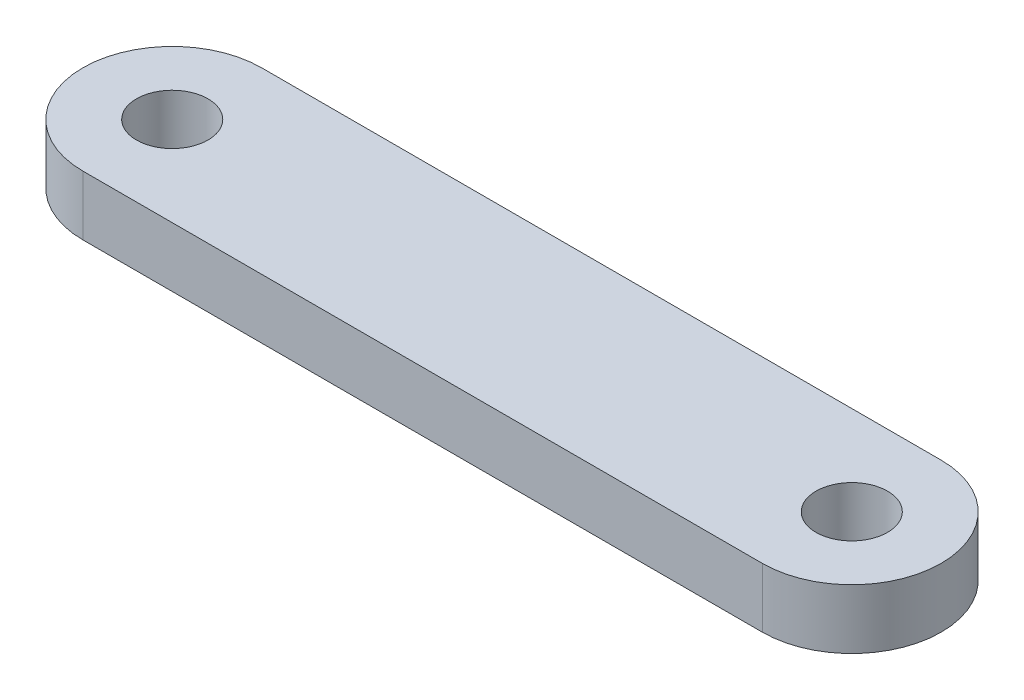
ISO-10303-21;
HEADER;
FILE_DESCRIPTION(('STEP AP214'),'2;1');
FILE_NAME('part.step','',(''),(''),'','','');
FILE_SCHEMA(('AUTOMOTIVE_DESIGN { 1 0 10303 214 1 1 1 1 }'));
ENDSEC;
DATA;
#1=APPLICATION_CONTEXT('core data for automotive mechanical design processes');
#2=APPLICATION_PROTOCOL_DEFINITION('international standard','automotive_design',2000,#1);
#3=PRODUCT_CONTEXT('',#1,'mechanical');
#4=PRODUCT('Part','Part','',(#3));
#5=PRODUCT_RELATED_PRODUCT_CATEGORY('part','',(#4));
#6=PRODUCT_DEFINITION_FORMATION('','',#4);
#7=PRODUCT_DEFINITION_CONTEXT('part definition',#1,'design');
#8=PRODUCT_DEFINITION('design','',#6,#7);
#9=PRODUCT_DEFINITION_SHAPE('','',#8);
#10=(LENGTH_UNIT() NAMED_UNIT(*) SI_UNIT(.MILLI.,.METRE.));
#11=(NAMED_UNIT(*) PLANE_ANGLE_UNIT() SI_UNIT($,.RADIAN.));
#12=(NAMED_UNIT(*) SI_UNIT($,.STERADIAN.) SOLID_ANGLE_UNIT());
#13=UNCERTAINTY_MEASURE_WITH_UNIT(LENGTH_MEASURE(1.E-05),#10,'distance_accuracy_value','');
#14=(GEOMETRIC_REPRESENTATION_CONTEXT(3) GLOBAL_UNCERTAINTY_ASSIGNED_CONTEXT((#13)) GLOBAL_UNIT_ASSIGNED_CONTEXT((#10,
#11,#12)) REPRESENTATION_CONTEXT('',''));
#15=CARTESIAN_POINT('',(0.,0.,0.));
#16=DIRECTION('',(0.,0.,1.));
#17=DIRECTION('',(1.,0.,0.));
#18=AXIS2_PLACEMENT_3D('',#15,#16,#17);
#19=CARTESIAN_POINT('',(0.,5.,0.));
#20=DIRECTION('',(0.,1.,0.));
#21=DIRECTION('',(0.,0.,1.));
#22=AXIS2_PLACEMENT_3D('',#19,#20,#21);
#23=PLANE('',#22);
#24=CARTESIAN_POINT('',(57.,5.,0.));
#25=DIRECTION('',(0.,1.,0.));
#26=DIRECTION('',(0.,0.,1.));
#27=AXIS2_PLACEMENT_3D('',#24,#25,#26);
#28=CIRCLE('',#27,3.00000000000001);
#29=CARTESIAN_POINT('',(57.,5.,3.00000000000001));
#30=VERTEX_POINT('',#29);
#31=EDGE_CURVE('E108',#30,#30,#28,.T.);
#32=ORIENTED_EDGE('',*,*,#31,.F.);
#33=EDGE_LOOP('',(#32));
#34=FACE_BOUND('',#33,.T.);
#35=CARTESIAN_POINT('',(0.,5.,0.));
#36=DIRECTION('',(0.,1.,0.));
#37=DIRECTION('',(0.,0.,1.));
#38=AXIS2_PLACEMENT_3D('',#35,#36,#37);
#39=CIRCLE('',#38,7.5);
#40=CARTESIAN_POINT('',(0.,5.,-7.5));
#41=VERTEX_POINT('',#40);
#42=CARTESIAN_POINT('',(0.,5.,7.5));
#43=VERTEX_POINT('',#42);
#44=EDGE_CURVE('E93',#41,#43,#39,.T.);
#45=ORIENTED_EDGE('',*,*,#44,.T.);
#46=DIRECTION('',(1.,0.,0.));
#47=VECTOR('',#46,1.);
#48=CARTESIAN_POINT('',(0.,5.,7.5));
#49=LINE('',#48,#47);
#50=CARTESIAN_POINT('',(57.,5.,7.5));
#51=VERTEX_POINT('',#50);
#52=EDGE_CURVE('E88',#43,#51,#49,.T.);
#53=ORIENTED_EDGE('',*,*,#52,.T.);
#54=CARTESIAN_POINT('',(57.,5.,0.));
#55=DIRECTION('',(0.,1.,0.));
#56=DIRECTION('',(0.,0.,1.));
#57=AXIS2_PLACEMENT_3D('',#54,#55,#56);
#58=CIRCLE('',#57,7.5);
#59=CARTESIAN_POINT('',(57.,5.,-7.5));
#60=VERTEX_POINT('',#59);
#61=EDGE_CURVE('E91',#51,#60,#58,.T.);
#62=ORIENTED_EDGE('',*,*,#61,.T.);
#63=DIRECTION('',(-1.,0.,0.));
#64=VECTOR('',#63,1.);
#65=CARTESIAN_POINT('',(0.,5.,-7.5));
#66=LINE('',#65,#64);
#67=EDGE_CURVE('E58',#60,#41,#66,.T.);
#68=ORIENTED_EDGE('',*,*,#67,.T.);
#69=EDGE_LOOP('',(#45,#53,#62,#68));
#70=FACE_BOUND('',#69,.T.);
#71=CARTESIAN_POINT('',(0.,5.,0.));
#72=DIRECTION('',(0.,1.,0.));
#73=DIRECTION('',(0.,0.,1.));
#74=AXIS2_PLACEMENT_3D('',#71,#72,#73);
#75=CIRCLE('',#74,3.);
#76=CARTESIAN_POINT('',(0.,5.,3.));
#77=VERTEX_POINT('',#76);
#78=EDGE_CURVE('E123',#77,#77,#75,.T.);
#79=ORIENTED_EDGE('',*,*,#78,.F.);
#80=EDGE_LOOP('',(#79));
#81=FACE_BOUND('',#80,.T.);
#82=ADVANCED_FACE('F41',(#34,#70,#81),#23,.T.);
#83=CARTESIAN_POINT('',(0.,0.,0.));
#84=DIRECTION('',(0.,1.,0.));
#85=DIRECTION('',(0.,0.,1.));
#86=AXIS2_PLACEMENT_3D('',#83,#84,#85);
#87=PLANE('',#86);
#88=CARTESIAN_POINT('',(0.,0.,0.));
#89=DIRECTION('',(0.,1.,0.));
#90=DIRECTION('',(0.,0.,1.));
#91=AXIS2_PLACEMENT_3D('',#88,#89,#90);
#92=CIRCLE('',#91,7.5);
#93=CARTESIAN_POINT('',(0.,0.,-7.5));
#94=VERTEX_POINT('',#93);
#95=CARTESIAN_POINT('',(0.,0.,7.5));
#96=VERTEX_POINT('',#95);
#97=EDGE_CURVE('E105',#94,#96,#92,.T.);
#98=ORIENTED_EDGE('',*,*,#97,.F.);
#99=DIRECTION('',(-1.,0.,0.));
#100=VECTOR('',#99,1.);
#101=CARTESIAN_POINT('',(0.,0.,-7.5));
#102=LINE('',#101,#100);
#103=CARTESIAN_POINT('',(57.,0.,-7.5));
#104=VERTEX_POINT('',#103);
#105=EDGE_CURVE('E81',#104,#94,#102,.T.);
#106=ORIENTED_EDGE('',*,*,#105,.F.);
#107=CARTESIAN_POINT('',(57.,0.,0.));
#108=DIRECTION('',(0.,1.,0.));
#109=DIRECTION('',(0.,0.,1.));
#110=AXIS2_PLACEMENT_3D('',#107,#108,#109);
#111=CIRCLE('',#110,7.5);
#112=CARTESIAN_POINT('',(57.,0.,7.5));
#113=VERTEX_POINT('',#112);
#114=EDGE_CURVE('E75',#113,#104,#111,.T.);
#115=ORIENTED_EDGE('',*,*,#114,.F.);
#116=DIRECTION('',(1.,0.,0.));
#117=VECTOR('',#116,1.);
#118=CARTESIAN_POINT('',(0.,0.,7.5));
#119=LINE('',#118,#117);
#120=EDGE_CURVE('E97',#96,#113,#119,.T.);
#121=ORIENTED_EDGE('',*,*,#120,.F.);
#122=EDGE_LOOP('',(#98,#106,#115,#121));
#123=FACE_BOUND('',#122,.T.);
#124=CARTESIAN_POINT('',(57.,0.,0.));
#125=DIRECTION('',(0.,1.,0.));
#126=DIRECTION('',(0.,0.,1.));
#127=AXIS2_PLACEMENT_3D('',#124,#125,#126);
#128=CIRCLE('',#127,3.00000000000001);
#129=CARTESIAN_POINT('',(57.,0.,3.00000000000001));
#130=VERTEX_POINT('',#129);
#131=EDGE_CURVE('E120',#130,#130,#128,.T.);
#132=ORIENTED_EDGE('',*,*,#131,.T.);
#133=EDGE_LOOP('',(#132));
#134=FACE_BOUND('',#133,.T.);
#135=CARTESIAN_POINT('',(0.,0.,0.));
#136=DIRECTION('',(0.,1.,0.));
#137=DIRECTION('',(0.,0.,1.));
#138=AXIS2_PLACEMENT_3D('',#135,#136,#137);
#139=CIRCLE('',#138,3.);
#140=CARTESIAN_POINT('',(0.,0.,3.));
#141=VERTEX_POINT('',#140);
#142=EDGE_CURVE('E126',#141,#141,#139,.T.);
#143=ORIENTED_EDGE('',*,*,#142,.T.);
#144=EDGE_LOOP('',(#143));
#145=FACE_BOUND('',#144,.T.);
#146=ADVANCED_FACE('F116',(#123,#134,#145),#87,.F.);
#147=CARTESIAN_POINT('',(0.,5.,0.));
#148=DIRECTION('',(0.,-1.,0.));
#149=DIRECTION('',(0.,0.,-1.));
#150=AXIS2_PLACEMENT_3D('',#147,#148,#149);
#151=CYLINDRICAL_SURFACE('',#150,7.5);
#152=ORIENTED_EDGE('',*,*,#97,.T.);
#153=DIRECTION('',(0.,-1.,0.));
#154=VECTOR('',#153,1.);
#155=CARTESIAN_POINT('',(0.,5.,7.5));
#156=LINE('',#155,#154);
#157=EDGE_CURVE('E11',#43,#96,#156,.T.);
#158=ORIENTED_EDGE('',*,*,#157,.F.);
#159=ORIENTED_EDGE('',*,*,#44,.F.);
#160=DIRECTION('',(0.,-1.,0.));
#161=VECTOR('',#160,1.);
#162=CARTESIAN_POINT('',(0.,5.,-7.5));
#163=LINE('',#162,#161);
#164=EDGE_CURVE('E101',#41,#94,#163,.T.);
#165=ORIENTED_EDGE('',*,*,#164,.T.);
#166=EDGE_LOOP('',(#152,#158,#159,#165));
#167=FACE_BOUND('',#166,.T.);
#168=ADVANCED_FACE('F43',(#167),#151,.T.);
#169=CARTESIAN_POINT('',(0.,5.,7.5));
#170=DIRECTION('',(0.,0.,-1.));
#171=DIRECTION('',(-1.,0.,0.));
#172=AXIS2_PLACEMENT_3D('',#169,#170,#171);
#173=PLANE('',#172);
#174=ORIENTED_EDGE('',*,*,#120,.T.);
#175=DIRECTION('',(0.,-1.,0.));
#176=VECTOR('',#175,1.);
#177=CARTESIAN_POINT('',(57.,5.,7.5));
#178=LINE('',#177,#176);
#179=EDGE_CURVE('E50',#51,#113,#178,.T.);
#180=ORIENTED_EDGE('',*,*,#179,.F.);
#181=ORIENTED_EDGE('',*,*,#52,.F.);
#182=ORIENTED_EDGE('',*,*,#157,.T.);
#183=EDGE_LOOP('',(#174,#180,#181,#182));
#184=FACE_BOUND('',#183,.T.);
#185=ADVANCED_FACE('F96',(#184),#173,.F.);
#186=CARTESIAN_POINT('',(57.,5.,0.));
#187=DIRECTION('',(0.,-1.,0.));
#188=DIRECTION('',(0.,0.,-1.));
#189=AXIS2_PLACEMENT_3D('',#186,#187,#188);
#190=CYLINDRICAL_SURFACE('',#189,7.5);
#191=ORIENTED_EDGE('',*,*,#114,.T.);
#192=DIRECTION('',(0.,-1.,0.));
#193=VECTOR('',#192,1.);
#194=CARTESIAN_POINT('',(57.,5.,-7.5));
#195=LINE('',#194,#193);
#196=EDGE_CURVE('E98',#60,#104,#195,.T.);
#197=ORIENTED_EDGE('',*,*,#196,.F.);
#198=ORIENTED_EDGE('',*,*,#61,.F.);
#199=ORIENTED_EDGE('',*,*,#179,.T.);
#200=EDGE_LOOP('',(#191,#197,#198,#199));
#201=FACE_BOUND('',#200,.T.);
#202=ADVANCED_FACE('F99',(#201),#190,.T.);
#203=CARTESIAN_POINT('',(0.,5.,-7.5));
#204=DIRECTION('',(0.,0.,1.));
#205=DIRECTION('',(1.,0.,0.));
#206=AXIS2_PLACEMENT_3D('',#203,#204,#205);
#207=PLANE('',#206);
#208=ORIENTED_EDGE('',*,*,#105,.T.);
#209=ORIENTED_EDGE('',*,*,#164,.F.);
#210=ORIENTED_EDGE('',*,*,#67,.F.);
#211=ORIENTED_EDGE('',*,*,#196,.T.);
#212=EDGE_LOOP('',(#208,#209,#210,#211));
#213=FACE_BOUND('',#212,.T.);
#214=ADVANCED_FACE('F113',(#213),#207,.F.);
#215=CARTESIAN_POINT('',(57.,5.,0.));
#216=DIRECTION('',(0.,-1.,0.));
#217=DIRECTION('',(0.,0.,-1.));
#218=AXIS2_PLACEMENT_3D('',#215,#216,#217);
#219=CYLINDRICAL_SURFACE('',#218,3.00000000000001);
#220=ORIENTED_EDGE('',*,*,#31,.T.);
#221=EDGE_LOOP('',(#220));
#222=FACE_BOUND('',#221,.T.);
#223=ORIENTED_EDGE('',*,*,#131,.F.);
#224=EDGE_LOOP('',(#223));
#225=FACE_BOUND('',#224,.T.);
#226=ADVANCED_FACE('F143',(#222,#225),#219,.F.);
#227=CARTESIAN_POINT('',(0.,5.,0.));
#228=DIRECTION('',(0.,-1.,0.));
#229=DIRECTION('',(0.,0.,-1.));
#230=AXIS2_PLACEMENT_3D('',#227,#228,#229);
#231=CYLINDRICAL_SURFACE('',#230,3.);
#232=ORIENTED_EDGE('',*,*,#78,.T.);
#233=EDGE_LOOP('',(#232));
#234=FACE_BOUND('',#233,.T.);
#235=ORIENTED_EDGE('',*,*,#142,.F.);
#236=EDGE_LOOP('',(#235));
#237=FACE_BOUND('',#236,.T.);
#238=ADVANCED_FACE('F132',(#234,#237),#231,.F.);
#239=CLOSED_SHELL('',(#82,#146,#168,#185,#202,#214,#226,#238));
#240=MANIFOLD_SOLID_BREP('B2',#239);
#241=ADVANCED_BREP_SHAPE_REPRESENTATION('',(#18,#240),#14);
#242=SHAPE_DEFINITION_REPRESENTATION(#9,#241);
ENDSEC;
END-ISO-10303-21;
